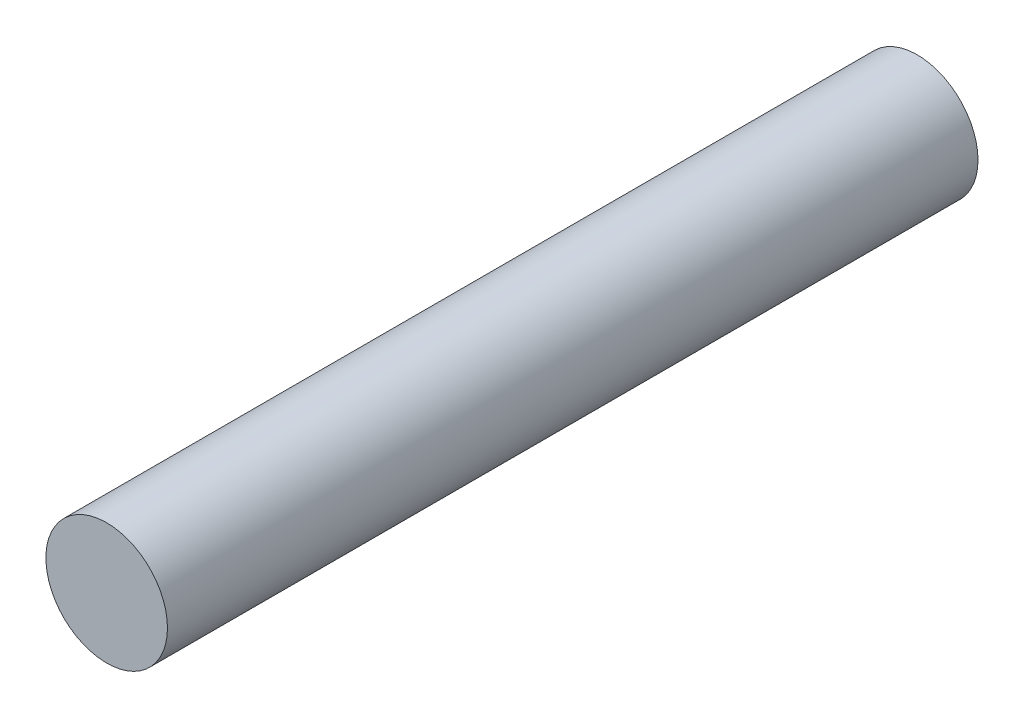
ISO-10303-21;
HEADER;
FILE_DESCRIPTION(('STEP AP214'),'2;1');
FILE_NAME('part.step','',(''),(''),'','','');
FILE_SCHEMA(('AUTOMOTIVE_DESIGN { 1 0 10303 214 1 1 1 1 }'));
ENDSEC;
DATA;
#1=APPLICATION_CONTEXT('core data for automotive mechanical design processes');
#2=APPLICATION_PROTOCOL_DEFINITION('international standard','automotive_design',2000,#1);
#3=PRODUCT_CONTEXT('',#1,'mechanical');
#4=PRODUCT('Part','Part','',(#3));
#5=PRODUCT_RELATED_PRODUCT_CATEGORY('part','',(#4));
#6=PRODUCT_DEFINITION_FORMATION('','',#4);
#7=PRODUCT_DEFINITION_CONTEXT('part definition',#1,'design');
#8=PRODUCT_DEFINITION('design','',#6,#7);
#9=PRODUCT_DEFINITION_SHAPE('','',#8);
#10=(LENGTH_UNIT() NAMED_UNIT(*) SI_UNIT(.MILLI.,.METRE.));
#11=(NAMED_UNIT(*) PLANE_ANGLE_UNIT() SI_UNIT($,.RADIAN.));
#12=(NAMED_UNIT(*) SI_UNIT($,.STERADIAN.) SOLID_ANGLE_UNIT());
#13=UNCERTAINTY_MEASURE_WITH_UNIT(LENGTH_MEASURE(1.E-05),#10,'distance_accuracy_value','');
#14=(GEOMETRIC_REPRESENTATION_CONTEXT(3) GLOBAL_UNCERTAINTY_ASSIGNED_CONTEXT((#13)) GLOBAL_UNIT_ASSIGNED_CONTEXT((#10,
#11,#12)) REPRESENTATION_CONTEXT('',''));
#15=CARTESIAN_POINT('',(0.,0.,0.));
#16=DIRECTION('',(0.,0.,1.));
#17=DIRECTION('',(1.,0.,0.));
#18=AXIS2_PLACEMENT_3D('',#15,#16,#17);
#19=CARTESIAN_POINT('',(0.,0.,20.));
#20=DIRECTION('',(0.,0.,-1.));
#21=DIRECTION('',(-1.,0.,0.));
#22=AXIS2_PLACEMENT_3D('',#19,#20,#21);
#23=CYLINDRICAL_SURFACE('',#22,1.5);
#24=CARTESIAN_POINT('',(0.,0.,20.));
#25=DIRECTION('',(0.,0.,1.));
#26=DIRECTION('',(1.,0.,0.));
#27=AXIS2_PLACEMENT_3D('',#24,#25,#26);
#28=CIRCLE('',#27,1.5);
#29=CARTESIAN_POINT('',(1.5,0.,20.));
#30=VERTEX_POINT('',#29);
#31=EDGE_CURVE('E10',#30,#30,#28,.T.);
#32=ORIENTED_EDGE('',*,*,#31,.F.);
#33=EDGE_LOOP('',(#32));
#34=FACE_BOUND('',#33,.T.);
#35=CARTESIAN_POINT('',(0.,0.,0.));
#36=DIRECTION('',(0.,0.,1.));
#37=DIRECTION('',(1.,0.,0.));
#38=AXIS2_PLACEMENT_3D('',#35,#36,#37);
#39=CIRCLE('',#38,1.5);
#40=CARTESIAN_POINT('',(1.5,0.,0.));
#41=VERTEX_POINT('',#40);
#42=EDGE_CURVE('E34',#41,#41,#39,.T.);
#43=ORIENTED_EDGE('',*,*,#42,.T.);
#44=EDGE_LOOP('',(#43));
#45=FACE_BOUND('',#44,.T.);
#46=ADVANCED_FACE('F31',(#34,#45),#23,.T.);
#47=CARTESIAN_POINT('',(0.,0.,20.));
#48=DIRECTION('',(0.,0.,1.));
#49=DIRECTION('',(1.,0.,0.));
#50=AXIS2_PLACEMENT_3D('',#47,#48,#49);
#51=PLANE('',#50);
#52=ORIENTED_EDGE('',*,*,#31,.T.);
#53=EDGE_LOOP('',(#52));
#54=FACE_BOUND('',#53,.T.);
#55=ADVANCED_FACE('F46',(#54),#51,.T.);
#56=CARTESIAN_POINT('',(0.,0.,0.));
#57=DIRECTION('',(0.,0.,1.));
#58=DIRECTION('',(1.,0.,0.));
#59=AXIS2_PLACEMENT_3D('',#56,#57,#58);
#60=PLANE('',#59);
#61=ORIENTED_EDGE('',*,*,#42,.F.);
#62=EDGE_LOOP('',(#61));
#63=FACE_BOUND('',#62,.T.);
#64=ADVANCED_FACE('F44',(#63),#60,.F.);
#65=CLOSED_SHELL('',(#46,#55,#64));
#66=MANIFOLD_SOLID_BREP('B2',#65);
#67=ADVANCED_BREP_SHAPE_REPRESENTATION('',(#18,#66),#14);
#68=SHAPE_DEFINITION_REPRESENTATION(#9,#67);
ENDSEC;
END-ISO-10303-21;
